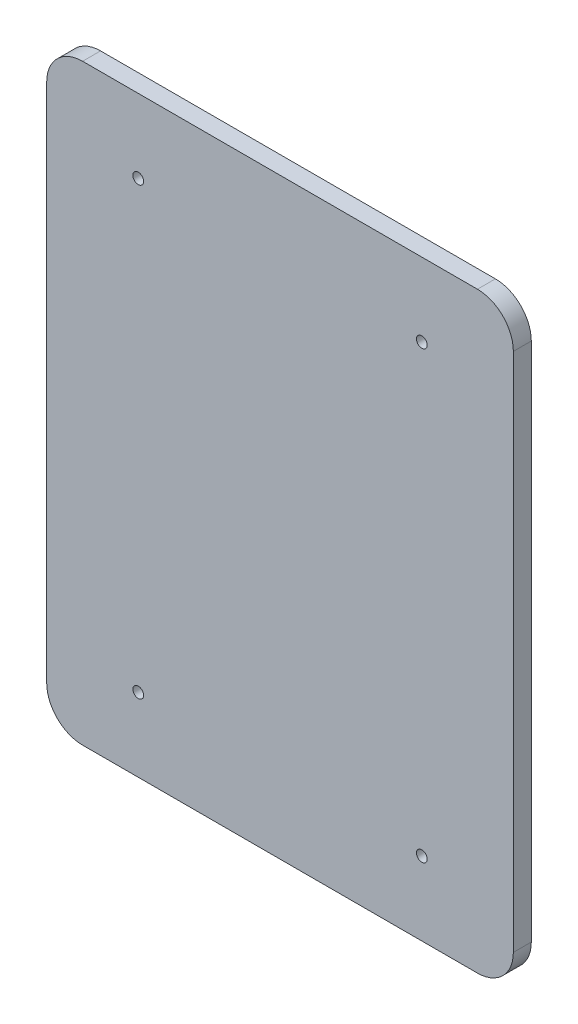
ISO-10303-21;
HEADER;
FILE_DESCRIPTION(('STEP AP214'),'2;1');
FILE_NAME('part.step','',(''),(''),'','','');
FILE_SCHEMA(('AUTOMOTIVE_DESIGN { 1 0 10303 214 1 1 1 1 }'));
ENDSEC;
DATA;
#1=APPLICATION_CONTEXT('core data for automotive mechanical design processes');
#2=APPLICATION_PROTOCOL_DEFINITION('international standard','automotive_design',2000,#1);
#3=PRODUCT_CONTEXT('',#1,'mechanical');
#4=PRODUCT('Part','Part','',(#3));
#5=PRODUCT_RELATED_PRODUCT_CATEGORY('part','',(#4));
#6=PRODUCT_DEFINITION_FORMATION('','',#4);
#7=PRODUCT_DEFINITION_CONTEXT('part definition',#1,'design');
#8=PRODUCT_DEFINITION('design','',#6,#7);
#9=PRODUCT_DEFINITION_SHAPE('','',#8);
#10=(LENGTH_UNIT() NAMED_UNIT(*) SI_UNIT(.MILLI.,.METRE.));
#11=(NAMED_UNIT(*) PLANE_ANGLE_UNIT() SI_UNIT($,.RADIAN.));
#12=(NAMED_UNIT(*) SI_UNIT($,.STERADIAN.) SOLID_ANGLE_UNIT());
#13=UNCERTAINTY_MEASURE_WITH_UNIT(LENGTH_MEASURE(1.E-05),#10,'distance_accuracy_value','');
#14=(GEOMETRIC_REPRESENTATION_CONTEXT(3) GLOBAL_UNCERTAINTY_ASSIGNED_CONTEXT((#13)) GLOBAL_UNIT_ASSIGNED_CONTEXT((#10,
#11,#12)) REPRESENTATION_CONTEXT('',''));
#15=CARTESIAN_POINT('',(0.,0.,0.));
#16=DIRECTION('',(0.,0.,1.));
#17=DIRECTION('',(1.,0.,0.));
#18=AXIS2_PLACEMENT_3D('',#15,#16,#17);
#19=CARTESIAN_POINT('',(-49.2171194490085,118.60614533863,5.));
#20=DIRECTION('',(0.,0.,-1.));
#21=DIRECTION('',(-1.,0.,0.));
#22=AXIS2_PLACEMENT_3D('',#19,#20,#21);
#23=CYLINDRICAL_SURFACE('',#22,10.);
#24=CARTESIAN_POINT('',(-49.2171194490085,118.60614533863,0.));
#25=DIRECTION('',(0.,0.,1.));
#26=DIRECTION('',(-1.,0.,0.));
#27=AXIS2_PLACEMENT_3D('',#24,#25,#26);
#28=CIRCLE('',#27,10.);
#29=CARTESIAN_POINT('',(-49.2171194490085,128.60614533863,0.));
#30=VERTEX_POINT('',#29);
#31=CARTESIAN_POINT('',(-59.2171194490085,118.60614533863,0.));
#32=VERTEX_POINT('',#31);
#33=EDGE_CURVE('E129',#30,#32,#28,.T.);
#34=ORIENTED_EDGE('',*,*,#33,.T.);
#35=DIRECTION('',(0.,0.,-1.));
#36=VECTOR('',#35,1.);
#37=CARTESIAN_POINT('',(-59.2171194490085,118.60614533863,5.));
#38=LINE('',#37,#36);
#39=CARTESIAN_POINT('',(-59.2171194490085,118.60614533863,5.));
#40=VERTEX_POINT('',#39);
#41=EDGE_CURVE('E11',#40,#32,#38,.T.);
#42=ORIENTED_EDGE('',*,*,#41,.F.);
#43=CARTESIAN_POINT('',(-49.2171194490085,118.60614533863,5.));
#44=DIRECTION('',(0.,0.,1.));
#45=DIRECTION('',(-1.,0.,0.));
#46=AXIS2_PLACEMENT_3D('',#43,#44,#45);
#47=CIRCLE('',#46,10.);
#48=CARTESIAN_POINT('',(-49.2171194490085,128.60614533863,5.));
#49=VERTEX_POINT('',#48);
#50=EDGE_CURVE('E144',#49,#40,#47,.T.);
#51=ORIENTED_EDGE('',*,*,#50,.F.);
#52=DIRECTION('',(0.,0.,-1.));
#53=VECTOR('',#52,1.);
#54=CARTESIAN_POINT('',(-49.2171194490085,128.60614533863,5.));
#55=LINE('',#54,#53);
#56=EDGE_CURVE('E125',#49,#30,#55,.T.);
#57=ORIENTED_EDGE('',*,*,#56,.T.);
#58=EDGE_LOOP('',(#34,#42,#51,#57));
#59=FACE_BOUND('',#58,.T.);
#60=ADVANCED_FACE('F33',(#59),#23,.T.);
#61=CARTESIAN_POINT('',(-59.2171194490085,-26.3938546613698,5.));
#62=DIRECTION('',(1.,0.,0.));
#63=DIRECTION('',(0.,0.,-1.));
#64=AXIS2_PLACEMENT_3D('',#61,#62,#63);
#65=PLANE('',#64);
#66=DIRECTION('',(0.,-1.,0.));
#67=VECTOR('',#66,1.);
#68=CARTESIAN_POINT('',(-59.2171194490085,-26.3938546613698,0.));
#69=LINE('',#68,#67);
#70=CARTESIAN_POINT('',(-59.2171194490085,-26.3938546613698,0.));
#71=VERTEX_POINT('',#70);
#72=EDGE_CURVE('E132',#32,#71,#69,.T.);
#73=ORIENTED_EDGE('',*,*,#72,.T.);
#74=DIRECTION('',(0.,0.,-1.));
#75=VECTOR('',#74,1.);
#76=CARTESIAN_POINT('',(-59.2171194490085,-26.3938546613698,5.));
#77=LINE('',#76,#75);
#78=CARTESIAN_POINT('',(-59.2171194490085,-26.3938546613698,5.));
#79=VERTEX_POINT('',#78);
#80=EDGE_CURVE('E41',#79,#71,#77,.T.);
#81=ORIENTED_EDGE('',*,*,#80,.F.);
#82=DIRECTION('',(0.,-1.,0.));
#83=VECTOR('',#82,1.);
#84=CARTESIAN_POINT('',(-59.2171194490085,-26.3938546613698,5.));
#85=LINE('',#84,#83);
#86=EDGE_CURVE('E92',#40,#79,#85,.T.);
#87=ORIENTED_EDGE('',*,*,#86,.F.);
#88=ORIENTED_EDGE('',*,*,#41,.T.);
#89=EDGE_LOOP('',(#73,#81,#87,#88));
#90=FACE_BOUND('',#89,.T.);
#91=ADVANCED_FACE('F232',(#90),#65,.F.);
#92=CARTESIAN_POINT('',(-49.2171194490085,-26.3938546613698,5.));
#93=DIRECTION('',(0.,0.,-1.));
#94=DIRECTION('',(-1.,0.,0.));
#95=AXIS2_PLACEMENT_3D('',#92,#93,#94);
#96=CYLINDRICAL_SURFACE('',#95,10.);
#97=CARTESIAN_POINT('',(-49.2171194490085,-26.3938546613698,0.));
#98=DIRECTION('',(0.,0.,1.));
#99=DIRECTION('',(-1.,0.,0.));
#100=AXIS2_PLACEMENT_3D('',#97,#98,#99);
#101=CIRCLE('',#100,10.);
#102=CARTESIAN_POINT('',(-49.2171194490085,-36.3938546613698,0.));
#103=VERTEX_POINT('',#102);
#104=EDGE_CURVE('E135',#71,#103,#101,.T.);
#105=ORIENTED_EDGE('',*,*,#104,.T.);
#106=DIRECTION('',(0.,0.,-1.));
#107=VECTOR('',#106,1.);
#108=CARTESIAN_POINT('',(-49.2171194490085,-36.3938546613698,5.));
#109=LINE('',#108,#107);
#110=CARTESIAN_POINT('',(-49.2171194490085,-36.3938546613698,5.));
#111=VERTEX_POINT('',#110);
#112=EDGE_CURVE('E151',#111,#103,#109,.T.);
#113=ORIENTED_EDGE('',*,*,#112,.F.);
#114=CARTESIAN_POINT('',(-49.2171194490085,-26.3938546613698,5.));
#115=DIRECTION('',(0.,0.,1.));
#116=DIRECTION('',(-1.,0.,0.));
#117=AXIS2_PLACEMENT_3D('',#114,#115,#116);
#118=CIRCLE('',#117,10.);
#119=EDGE_CURVE('E159',#79,#111,#118,.T.);
#120=ORIENTED_EDGE('',*,*,#119,.F.);
#121=ORIENTED_EDGE('',*,*,#80,.T.);
#122=EDGE_LOOP('',(#105,#113,#120,#121));
#123=FACE_BOUND('',#122,.T.);
#124=ADVANCED_FACE('F157',(#123),#96,.T.);
#125=CARTESIAN_POINT('',(-49.2171194490085,-36.3938546613698,5.));
#126=DIRECTION('',(0.,1.,0.));
#127=DIRECTION('',(0.,0.,1.));
#128=AXIS2_PLACEMENT_3D('',#125,#126,#127);
#129=PLANE('',#128);
#130=DIRECTION('',(1.,0.,0.));
#131=VECTOR('',#130,1.);
#132=CARTESIAN_POINT('',(-49.2171194490085,-36.3938546613698,0.));
#133=LINE('',#132,#131);
#134=CARTESIAN_POINT('',(60.7828805509914,-36.3938546613698,0.));
#135=VERTEX_POINT('',#134);
#136=EDGE_CURVE('E137',#103,#135,#133,.T.);
#137=ORIENTED_EDGE('',*,*,#136,.T.);
#138=DIRECTION('',(0.,0.,-1.));
#139=VECTOR('',#138,1.);
#140=CARTESIAN_POINT('',(60.7828805509914,-36.3938546613698,5.));
#141=LINE('',#140,#139);
#142=CARTESIAN_POINT('',(60.7828805509914,-36.3938546613698,5.));
#143=VERTEX_POINT('',#142);
#144=EDGE_CURVE('E148',#143,#135,#141,.T.);
#145=ORIENTED_EDGE('',*,*,#144,.F.);
#146=DIRECTION('',(1.,0.,0.));
#147=VECTOR('',#146,1.);
#148=CARTESIAN_POINT('',(-49.2171194490085,-36.3938546613698,5.));
#149=LINE('',#148,#147);
#150=EDGE_CURVE('E171',#111,#143,#149,.T.);
#151=ORIENTED_EDGE('',*,*,#150,.F.);
#152=ORIENTED_EDGE('',*,*,#112,.T.);
#153=EDGE_LOOP('',(#137,#145,#151,#152));
#154=FACE_BOUND('',#153,.T.);
#155=ADVANCED_FACE('F167',(#154),#129,.F.);
#156=CARTESIAN_POINT('',(60.7828805509915,-26.3938546613698,5.));
#157=DIRECTION('',(0.,0.,-1.));
#158=DIRECTION('',(-1.,0.,0.));
#159=AXIS2_PLACEMENT_3D('',#156,#157,#158);
#160=CYLINDRICAL_SURFACE('',#159,10.);
#161=CARTESIAN_POINT('',(60.7828805509915,-26.3938546613698,0.));
#162=DIRECTION('',(0.,0.,1.));
#163=DIRECTION('',(1.,0.,0.));
#164=AXIS2_PLACEMENT_3D('',#161,#162,#163);
#165=CIRCLE('',#164,10.);
#166=CARTESIAN_POINT('',(70.7828805509915,-26.3938546613698,0.));
#167=VERTEX_POINT('',#166);
#168=EDGE_CURVE('E139',#135,#167,#165,.T.);
#169=ORIENTED_EDGE('',*,*,#168,.T.);
#170=DIRECTION('',(0.,0.,-1.));
#171=VECTOR('',#170,1.);
#172=CARTESIAN_POINT('',(70.7828805509915,-26.3938546613698,5.));
#173=LINE('',#172,#171);
#174=CARTESIAN_POINT('',(70.7828805509915,-26.3938546613698,5.));
#175=VERTEX_POINT('',#174);
#176=EDGE_CURVE('E120',#175,#167,#173,.T.);
#177=ORIENTED_EDGE('',*,*,#176,.F.);
#178=CARTESIAN_POINT('',(60.7828805509915,-26.3938546613698,5.));
#179=DIRECTION('',(0.,0.,1.));
#180=DIRECTION('',(1.,0.,0.));
#181=AXIS2_PLACEMENT_3D('',#178,#179,#180);
#182=CIRCLE('',#181,10.);
#183=EDGE_CURVE('E111',#143,#175,#182,.T.);
#184=ORIENTED_EDGE('',*,*,#183,.F.);
#185=ORIENTED_EDGE('',*,*,#144,.T.);
#186=EDGE_LOOP('',(#169,#177,#184,#185));
#187=FACE_BOUND('',#186,.T.);
#188=ADVANCED_FACE('F170',(#187),#160,.T.);
#189=CARTESIAN_POINT('',(70.7828805509915,-26.3938546613698,5.));
#190=DIRECTION('',(-1.,0.,0.));
#191=DIRECTION('',(0.,0.,1.));
#192=AXIS2_PLACEMENT_3D('',#189,#190,#191);
#193=PLANE('',#192);
#194=DIRECTION('',(0.,1.,0.));
#195=VECTOR('',#194,1.);
#196=CARTESIAN_POINT('',(70.7828805509915,-26.3938546613698,0.));
#197=LINE('',#196,#195);
#198=CARTESIAN_POINT('',(70.7828805509915,118.60614533863,0.));
#199=VERTEX_POINT('',#198);
#200=EDGE_CURVE('E119',#167,#199,#197,.T.);
#201=ORIENTED_EDGE('',*,*,#200,.T.);
#202=DIRECTION('',(0.,0.,-1.));
#203=VECTOR('',#202,1.);
#204=CARTESIAN_POINT('',(70.7828805509915,118.60614533863,5.));
#205=LINE('',#204,#203);
#206=CARTESIAN_POINT('',(70.7828805509915,118.60614533863,5.));
#207=VERTEX_POINT('',#206);
#208=EDGE_CURVE('E116',#207,#199,#205,.T.);
#209=ORIENTED_EDGE('',*,*,#208,.F.);
#210=DIRECTION('',(0.,1.,0.));
#211=VECTOR('',#210,1.);
#212=CARTESIAN_POINT('',(70.7828805509915,-26.3938546613698,5.));
#213=LINE('',#212,#211);
#214=EDGE_CURVE('E105',#175,#207,#213,.T.);
#215=ORIENTED_EDGE('',*,*,#214,.F.);
#216=ORIENTED_EDGE('',*,*,#176,.T.);
#217=EDGE_LOOP('',(#201,#209,#215,#216));
#218=FACE_BOUND('',#217,.T.);
#219=ADVANCED_FACE('F117',(#218),#193,.F.);
#220=CARTESIAN_POINT('',(60.7828805509915,118.60614533863,5.));
#221=DIRECTION('',(0.,0.,-1.));
#222=DIRECTION('',(-1.,0.,0.));
#223=AXIS2_PLACEMENT_3D('',#220,#221,#222);
#224=CYLINDRICAL_SURFACE('',#223,10.);
#225=CARTESIAN_POINT('',(60.7828805509915,118.60614533863,0.));
#226=DIRECTION('',(0.,0.,1.));
#227=DIRECTION('',(-1.,0.,0.));
#228=AXIS2_PLACEMENT_3D('',#225,#226,#227);
#229=CIRCLE('',#228,10.);
#230=CARTESIAN_POINT('',(60.7828805509914,128.60614533863,0.));
#231=VERTEX_POINT('',#230);
#232=EDGE_CURVE('E78',#199,#231,#229,.T.);
#233=ORIENTED_EDGE('',*,*,#232,.T.);
#234=DIRECTION('',(0.,0.,-1.));
#235=VECTOR('',#234,1.);
#236=CARTESIAN_POINT('',(60.7828805509914,128.60614533863,5.));
#237=LINE('',#236,#235);
#238=CARTESIAN_POINT('',(60.7828805509914,128.60614533863,5.));
#239=VERTEX_POINT('',#238);
#240=EDGE_CURVE('E121',#239,#231,#237,.T.);
#241=ORIENTED_EDGE('',*,*,#240,.F.);
#242=CARTESIAN_POINT('',(60.7828805509915,118.60614533863,5.));
#243=DIRECTION('',(0.,0.,1.));
#244=DIRECTION('',(-1.,0.,0.));
#245=AXIS2_PLACEMENT_3D('',#242,#243,#244);
#246=CIRCLE('',#245,10.);
#247=EDGE_CURVE('E109',#207,#239,#246,.T.);
#248=ORIENTED_EDGE('',*,*,#247,.F.);
#249=ORIENTED_EDGE('',*,*,#208,.T.);
#250=EDGE_LOOP('',(#233,#241,#248,#249));
#251=FACE_BOUND('',#250,.T.);
#252=ADVANCED_FACE('F123',(#251),#224,.T.);
#253=CARTESIAN_POINT('',(-49.2171194490085,128.60614533863,5.));
#254=DIRECTION('',(0.,-1.,0.));
#255=DIRECTION('',(0.,0.,-1.));
#256=AXIS2_PLACEMENT_3D('',#253,#254,#255);
#257=PLANE('',#256);
#258=DIRECTION('',(-1.,0.,0.));
#259=VECTOR('',#258,1.);
#260=CARTESIAN_POINT('',(-49.2171194490085,128.60614533863,0.));
#261=LINE('',#260,#259);
#262=EDGE_CURVE('E84',#231,#30,#261,.T.);
#263=ORIENTED_EDGE('',*,*,#262,.T.);
#264=ORIENTED_EDGE('',*,*,#56,.F.);
#265=DIRECTION('',(-1.,0.,0.));
#266=VECTOR('',#265,1.);
#267=CARTESIAN_POINT('',(-49.2171194490085,128.60614533863,5.));
#268=LINE('',#267,#266);
#269=EDGE_CURVE('E49',#239,#49,#268,.T.);
#270=ORIENTED_EDGE('',*,*,#269,.F.);
#271=ORIENTED_EDGE('',*,*,#240,.T.);
#272=EDGE_LOOP('',(#263,#264,#270,#271));
#273=FACE_BOUND('',#272,.T.);
#274=ADVANCED_FACE('F239',(#273),#257,.F.);
#275=CARTESIAN_POINT('',(-49.2171194490085,118.60614533863,5.));
#276=DIRECTION('',(0.,0.,-1.));
#277=DIRECTION('',(-1.,0.,0.));
#278=AXIS2_PLACEMENT_3D('',#275,#276,#277);
#279=PLANE('',#278);
#280=CARTESIAN_POINT('',(-33.7171194490085,108.10614533863,5.));
#281=DIRECTION('',(0.,0.,-1.));
#282=DIRECTION('',(-1.,0.,0.));
#283=AXIS2_PLACEMENT_3D('',#280,#281,#282);
#284=CIRCLE('',#283,1.5);
#285=CARTESIAN_POINT('',(-35.2171194490085,108.10614533863,5.));
#286=VERTEX_POINT('',#285);
#287=EDGE_CURVE('E180',#286,#286,#284,.T.);
#288=ORIENTED_EDGE('',*,*,#287,.T.);
#289=EDGE_LOOP('',(#288));
#290=FACE_BOUND('',#289,.T.);
#291=CARTESIAN_POINT('',(45.2828805509915,-15.8938546613698,5.));
#292=DIRECTION('',(0.,0.,-1.));
#293=DIRECTION('',(-1.,0.,0.));
#294=AXIS2_PLACEMENT_3D('',#291,#292,#293);
#295=CIRCLE('',#294,1.5);
#296=CARTESIAN_POINT('',(43.7828805509915,-15.8938546613698,5.));
#297=VERTEX_POINT('',#296);
#298=EDGE_CURVE('E192',#297,#297,#295,.T.);
#299=ORIENTED_EDGE('',*,*,#298,.T.);
#300=EDGE_LOOP('',(#299));
#301=FACE_BOUND('',#300,.T.);
#302=CARTESIAN_POINT('',(45.2828805509915,108.10614533863,5.));
#303=DIRECTION('',(0.,0.,-1.));
#304=DIRECTION('',(-1.,0.,0.));
#305=AXIS2_PLACEMENT_3D('',#302,#303,#304);
#306=CIRCLE('',#305,1.5);
#307=CARTESIAN_POINT('',(43.7828805509915,108.10614533863,5.));
#308=VERTEX_POINT('',#307);
#309=EDGE_CURVE('E186',#308,#308,#306,.T.);
#310=ORIENTED_EDGE('',*,*,#309,.T.);
#311=EDGE_LOOP('',(#310));
#312=FACE_BOUND('',#311,.T.);
#313=CARTESIAN_POINT('',(-33.7171194490085,-15.8938546613698,5.));
#314=DIRECTION('',(0.,0.,-1.));
#315=DIRECTION('',(-1.,0.,0.));
#316=AXIS2_PLACEMENT_3D('',#313,#314,#315);
#317=CIRCLE('',#316,1.5);
#318=CARTESIAN_POINT('',(-35.2171194490085,-15.8938546613698,5.));
#319=VERTEX_POINT('',#318);
#320=EDGE_CURVE('E133',#319,#319,#317,.T.);
#321=ORIENTED_EDGE('',*,*,#320,.T.);
#322=EDGE_LOOP('',(#321));
#323=FACE_BOUND('',#322,.T.);
#324=ORIENTED_EDGE('',*,*,#50,.T.);
#325=ORIENTED_EDGE('',*,*,#86,.T.);
#326=ORIENTED_EDGE('',*,*,#119,.T.);
#327=ORIENTED_EDGE('',*,*,#150,.T.);
#328=ORIENTED_EDGE('',*,*,#183,.T.);
#329=ORIENTED_EDGE('',*,*,#214,.T.);
#330=ORIENTED_EDGE('',*,*,#247,.T.);
#331=ORIENTED_EDGE('',*,*,#269,.T.);
#332=EDGE_LOOP('',(#324,#325,#326,#327,#328,#329,#330,#331));
#333=FACE_BOUND('',#332,.T.);
#334=ADVANCED_FACE('F107',(#290,#301,#312,#323,#333),#279,.F.);
#335=CARTESIAN_POINT('',(-49.2171194490085,118.60614533863,0.));
#336=DIRECTION('',(0.,0.,-1.));
#337=DIRECTION('',(-1.,0.,0.));
#338=AXIS2_PLACEMENT_3D('',#335,#336,#337);
#339=PLANE('',#338);
#340=CARTESIAN_POINT('',(-33.7171194490085,108.10614533863,0.));
#341=DIRECTION('',(0.,0.,-1.));
#342=DIRECTION('',(-1.,0.,0.));
#343=AXIS2_PLACEMENT_3D('',#340,#341,#342);
#344=CIRCLE('',#343,1.5);
#345=CARTESIAN_POINT('',(-35.2171194490085,108.10614533863,0.));
#346=VERTEX_POINT('',#345);
#347=EDGE_CURVE('E195',#346,#346,#344,.T.);
#348=ORIENTED_EDGE('',*,*,#347,.F.);
#349=EDGE_LOOP('',(#348));
#350=FACE_BOUND('',#349,.T.);
#351=CARTESIAN_POINT('',(45.2828805509915,-15.8938546613698,0.));
#352=DIRECTION('',(0.,0.,-1.));
#353=DIRECTION('',(-1.,0.,0.));
#354=AXIS2_PLACEMENT_3D('',#351,#352,#353);
#355=CIRCLE('',#354,1.5);
#356=CARTESIAN_POINT('',(43.7828805509915,-15.8938546613698,0.));
#357=VERTEX_POINT('',#356);
#358=EDGE_CURVE('E189',#357,#357,#355,.T.);
#359=ORIENTED_EDGE('',*,*,#358,.F.);
#360=EDGE_LOOP('',(#359));
#361=FACE_BOUND('',#360,.T.);
#362=CARTESIAN_POINT('',(45.2828805509915,108.10614533863,0.));
#363=DIRECTION('',(0.,0.,-1.));
#364=DIRECTION('',(-1.,0.,0.));
#365=AXIS2_PLACEMENT_3D('',#362,#363,#364);
#366=CIRCLE('',#365,1.5);
#367=CARTESIAN_POINT('',(43.7828805509915,108.10614533863,0.));
#368=VERTEX_POINT('',#367);
#369=EDGE_CURVE('E183',#368,#368,#366,.T.);
#370=ORIENTED_EDGE('',*,*,#369,.F.);
#371=EDGE_LOOP('',(#370));
#372=FACE_BOUND('',#371,.T.);
#373=CARTESIAN_POINT('',(-33.7171194490085,-15.8938546613698,0.));
#374=DIRECTION('',(0.,0.,-1.));
#375=DIRECTION('',(-1.,0.,0.));
#376=AXIS2_PLACEMENT_3D('',#373,#374,#375);
#377=CIRCLE('',#376,1.5);
#378=CARTESIAN_POINT('',(-35.2171194490085,-15.8938546613698,0.));
#379=VERTEX_POINT('',#378);
#380=EDGE_CURVE('E177',#379,#379,#377,.T.);
#381=ORIENTED_EDGE('',*,*,#380,.F.);
#382=EDGE_LOOP('',(#381));
#383=FACE_BOUND('',#382,.T.);
#384=ORIENTED_EDGE('',*,*,#33,.F.);
#385=ORIENTED_EDGE('',*,*,#262,.F.);
#386=ORIENTED_EDGE('',*,*,#232,.F.);
#387=ORIENTED_EDGE('',*,*,#200,.F.);
#388=ORIENTED_EDGE('',*,*,#168,.F.);
#389=ORIENTED_EDGE('',*,*,#136,.F.);
#390=ORIENTED_EDGE('',*,*,#104,.F.);
#391=ORIENTED_EDGE('',*,*,#72,.F.);
#392=EDGE_LOOP('',(#384,#385,#386,#387,#388,#389,#390,#391));
#393=FACE_BOUND('',#392,.T.);
#394=ADVANCED_FACE('F163',(#350,#361,#372,#383,#393),#339,.T.);
#395=CARTESIAN_POINT('',(-33.7171194490085,-15.8938546613698,5.));
#396=DIRECTION('',(0.,0.,-1.));
#397=DIRECTION('',(-1.,0.,0.));
#398=AXIS2_PLACEMENT_3D('',#395,#396,#397);
#399=CYLINDRICAL_SURFACE('',#398,1.5);
#400=ORIENTED_EDGE('',*,*,#320,.F.);
#401=EDGE_LOOP('',(#400));
#402=FACE_BOUND('',#401,.T.);
#403=ORIENTED_EDGE('',*,*,#380,.T.);
#404=EDGE_LOOP('',(#403));
#405=FACE_BOUND('',#404,.T.);
#406=ADVANCED_FACE('F212',(#402,#405),#399,.F.);
#407=CARTESIAN_POINT('',(45.2828805509915,108.10614533863,5.));
#408=DIRECTION('',(0.,0.,-1.));
#409=DIRECTION('',(-1.,0.,0.));
#410=AXIS2_PLACEMENT_3D('',#407,#408,#409);
#411=CYLINDRICAL_SURFACE('',#410,1.5);
#412=ORIENTED_EDGE('',*,*,#309,.F.);
#413=EDGE_LOOP('',(#412));
#414=FACE_BOUND('',#413,.T.);
#415=ORIENTED_EDGE('',*,*,#369,.T.);
#416=EDGE_LOOP('',(#415));
#417=FACE_BOUND('',#416,.T.);
#418=ADVANCED_FACE('F221',(#414,#417),#411,.F.);
#419=CARTESIAN_POINT('',(45.2828805509915,-15.8938546613698,5.));
#420=DIRECTION('',(0.,0.,-1.));
#421=DIRECTION('',(-1.,0.,0.));
#422=AXIS2_PLACEMENT_3D('',#419,#420,#421);
#423=CYLINDRICAL_SURFACE('',#422,1.5);
#424=ORIENTED_EDGE('',*,*,#298,.F.);
#425=EDGE_LOOP('',(#424));
#426=FACE_BOUND('',#425,.T.);
#427=ORIENTED_EDGE('',*,*,#358,.T.);
#428=EDGE_LOOP('',(#427));
#429=FACE_BOUND('',#428,.T.);
#430=ADVANCED_FACE('F206',(#426,#429),#423,.F.);
#431=CARTESIAN_POINT('',(-33.7171194490085,108.10614533863,5.));
#432=DIRECTION('',(0.,0.,-1.));
#433=DIRECTION('',(-1.,0.,0.));
#434=AXIS2_PLACEMENT_3D('',#431,#432,#433);
#435=CYLINDRICAL_SURFACE('',#434,1.5);
#436=ORIENTED_EDGE('',*,*,#287,.F.);
#437=EDGE_LOOP('',(#436));
#438=FACE_BOUND('',#437,.T.);
#439=ORIENTED_EDGE('',*,*,#347,.T.);
#440=EDGE_LOOP('',(#439));
#441=FACE_BOUND('',#440,.T.);
#442=ADVANCED_FACE('F203',(#438,#441),#435,.F.);
#443=CLOSED_SHELL('',(#60,#91,#124,#155,#188,#219,#252,#274,#334,#394,#406,#418,#430,#442));
#444=MANIFOLD_SOLID_BREP('B2',#443);
#445=ADVANCED_BREP_SHAPE_REPRESENTATION('',(#18,#444),#14);
#446=SHAPE_DEFINITION_REPRESENTATION(#9,#445);
ENDSEC;
END-ISO-10303-21;
